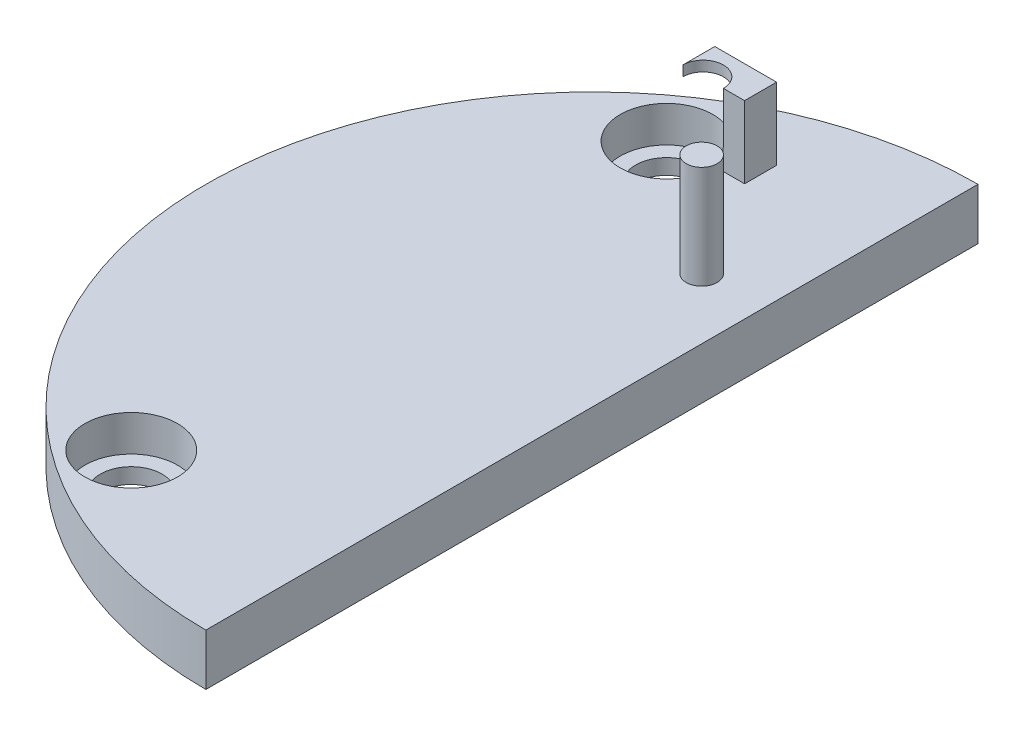
ISO-10303-21;
HEADER;
FILE_DESCRIPTION(('STEP AP214'),'2;1');
FILE_NAME('part.step','',(''),(''),'','','');
FILE_SCHEMA(('AUTOMOTIVE_DESIGN { 1 0 10303 214 1 1 1 1 }'));
ENDSEC;
DATA;
#1=APPLICATION_CONTEXT('core data for automotive mechanical design processes');
#2=APPLICATION_PROTOCOL_DEFINITION('international standard','automotive_design',2000,#1);
#3=PRODUCT_CONTEXT('',#1,'mechanical');
#4=PRODUCT('Part','Part','',(#3));
#5=PRODUCT_RELATED_PRODUCT_CATEGORY('part','',(#4));
#6=PRODUCT_DEFINITION_FORMATION('','',#4);
#7=PRODUCT_DEFINITION_CONTEXT('part definition',#1,'design');
#8=PRODUCT_DEFINITION('design','',#6,#7);
#9=PRODUCT_DEFINITION_SHAPE('','',#8);
#10=(LENGTH_UNIT() NAMED_UNIT(*) SI_UNIT(.MILLI.,.METRE.));
#11=(NAMED_UNIT(*) PLANE_ANGLE_UNIT() SI_UNIT($,.RADIAN.));
#12=(NAMED_UNIT(*) SI_UNIT($,.STERADIAN.) SOLID_ANGLE_UNIT());
#13=UNCERTAINTY_MEASURE_WITH_UNIT(LENGTH_MEASURE(1.E-05),#10,'distance_accuracy_value','');
#14=(GEOMETRIC_REPRESENTATION_CONTEXT(3) GLOBAL_UNCERTAINTY_ASSIGNED_CONTEXT((#13)) GLOBAL_UNIT_ASSIGNED_CONTEXT((#10,
#11,#12)) REPRESENTATION_CONTEXT('',''));
#15=CARTESIAN_POINT('',(0.,0.,0.));
#16=DIRECTION('',(0.,0.,1.));
#17=DIRECTION('',(1.,0.,0.));
#18=AXIS2_PLACEMENT_3D('',#15,#16,#17);
#19=CARTESIAN_POINT('',(0.,5.,37.5));
#20=DIRECTION('',(0.,-1.,0.));
#21=DIRECTION('',(0.,0.,-1.));
#22=AXIS2_PLACEMENT_3D('',#19,#20,#21);
#23=PLANE('',#22);
#24=CARTESIAN_POINT('',(-5.90512094525042,5.,20.9372129422284));
#25=DIRECTION('',(0.,-1.,0.));
#26=DIRECTION('',(0.,0.,-1.));
#27=AXIS2_PLACEMENT_3D('',#24,#25,#26);
#28=CIRCLE('',#27,1.5);
#29=CARTESIAN_POINT('',(-5.90512094525042,5.,19.4372129422284));
#30=VERTEX_POINT('',#29);
#31=EDGE_CURVE('E11',#30,#30,#28,.F.);
#32=ORIENTED_EDGE('',*,*,#31,.F.);
#33=EDGE_LOOP('',(#32));
#34=FACE_BOUND('',#33,.T.);
#35=CARTESIAN_POINT('',(0.,5.,37.5));
#36=DIRECTION('',(0.,1.,0.));
#37=DIRECTION('',(0.,0.,-1.));
#38=AXIS2_PLACEMENT_3D('',#35,#36,#37);
#39=CIRCLE('',#38,37.5);
#40=CARTESIAN_POINT('',(0.,5.,0.));
#41=VERTEX_POINT('',#40);
#42=CARTESIAN_POINT('',(0.,5.,75.));
#43=VERTEX_POINT('',#42);
#44=EDGE_CURVE('E208',#41,#43,#39,.T.);
#45=ORIENTED_EDGE('',*,*,#44,.T.);
#46=DIRECTION('',(0.,0.,-1.));
#47=VECTOR('',#46,1.);
#48=CARTESIAN_POINT('',(0.,5.,0.));
#49=LINE('',#48,#47);
#50=EDGE_CURVE('E211',#43,#41,#49,.T.);
#51=ORIENTED_EDGE('',*,*,#50,.T.);
#52=EDGE_LOOP('',(#45,#51));
#53=FACE_BOUND('',#52,.T.);
#54=CARTESIAN_POINT('',(-18.75,5.,63.5));
#55=DIRECTION('',(0.,1.,0.));
#56=DIRECTION('',(0.,0.,1.));
#57=AXIS2_PLACEMENT_3D('',#54,#55,#56);
#58=CIRCLE('',#57,4.5);
#59=CARTESIAN_POINT('',(-18.75,5.,68.));
#60=VERTEX_POINT('',#59);
#61=EDGE_CURVE('E187',#60,#60,#58,.T.);
#62=ORIENTED_EDGE('',*,*,#61,.F.);
#63=EDGE_LOOP('',(#62));
#64=FACE_BOUND('',#63,.T.);
#65=CARTESIAN_POINT('',(-18.75,5.,11.5));
#66=DIRECTION('',(0.,1.,0.));
#67=DIRECTION('',(0.,0.,1.));
#68=AXIS2_PLACEMENT_3D('',#65,#66,#67);
#69=CIRCLE('',#68,4.5);
#70=CARTESIAN_POINT('',(-18.75,5.,16.));
#71=VERTEX_POINT('',#70);
#72=EDGE_CURVE('E200',#71,#71,#69,.T.);
#73=ORIENTED_EDGE('',*,*,#72,.F.);
#74=EDGE_LOOP('',(#73));
#75=FACE_BOUND('',#74,.T.);
#76=DIRECTION('',(0.,0.,1.));
#77=VECTOR('',#76,1.);
#78=CARTESIAN_POINT('',(-13.4590865717171,5.,8.19163565060603));
#79=LINE('',#78,#77);
#80=CARTESIAN_POINT('',(-13.4590865717171,5.,8.19163565060603));
#81=VERTEX_POINT('',#80);
#82=CARTESIAN_POINT('',(-13.4590865717171,5.,11.2984068210427));
#83=VERTEX_POINT('',#82);
#84=EDGE_CURVE('E161',#81,#83,#79,.T.);
#85=ORIENTED_EDGE('',*,*,#84,.F.);
#86=DIRECTION('',(-1.,0.,0.));
#87=VECTOR('',#86,1.);
#88=CARTESIAN_POINT('',(-11.3733239640253,5.,8.19163565060603));
#89=LINE('',#88,#87);
#90=CARTESIAN_POINT('',(-11.3733239640253,5.,8.19163565060603));
#91=VERTEX_POINT('',#90);
#92=EDGE_CURVE('E166',#91,#81,#89,.T.);
#93=ORIENTED_EDGE('',*,*,#92,.F.);
#94=DIRECTION('',(0.,0.,-1.));
#95=VECTOR('',#94,1.);
#96=CARTESIAN_POINT('',(-11.3733239640253,5.,8.19163565060603));
#97=LINE('',#96,#95);
#98=CARTESIAN_POINT('',(-11.3733239640253,5.,11.2984068210427));
#99=VERTEX_POINT('',#98);
#100=EDGE_CURVE('E61',#99,#91,#97,.T.);
#101=ORIENTED_EDGE('',*,*,#100,.F.);
#102=DIRECTION('',(1.,0.,0.));
#103=VECTOR('',#102,1.);
#104=CARTESIAN_POINT('',(-13.4590865717171,5.,11.2984068210427));
#105=LINE('',#104,#103);
#106=EDGE_CURVE('E169',#83,#99,#105,.T.);
#107=ORIENTED_EDGE('',*,*,#106,.F.);
#108=EDGE_LOOP('',(#85,#93,#101,#107));
#109=FACE_BOUND('',#108,.T.);
#110=ADVANCED_FACE('F39',(#34,#53,#64,#75,#109),#23,.F.);
#111=CARTESIAN_POINT('',(0.,5.,37.5));
#112=DIRECTION('',(0.,-1.,0.));
#113=DIRECTION('',(0.,0.,-1.));
#114=AXIS2_PLACEMENT_3D('',#111,#112,#113);
#115=CYLINDRICAL_SURFACE('',#114,37.5);
#116=CARTESIAN_POINT('',(0.,0.,37.5));
#117=DIRECTION('',(0.,1.,0.));
#118=DIRECTION('',(0.,0.,-1.));
#119=AXIS2_PLACEMENT_3D('',#116,#117,#118);
#120=CIRCLE('',#119,37.5);
#121=CARTESIAN_POINT('',(0.,0.,0.));
#122=VERTEX_POINT('',#121);
#123=CARTESIAN_POINT('',(0.,0.,75.));
#124=VERTEX_POINT('',#123);
#125=EDGE_CURVE('E199',#122,#124,#120,.T.);
#126=ORIENTED_EDGE('',*,*,#125,.T.);
#127=DIRECTION('',(0.,-1.,0.));
#128=VECTOR('',#127,1.);
#129=CARTESIAN_POINT('',(0.,5.,75.));
#130=LINE('',#129,#128);
#131=EDGE_CURVE('E220',#43,#124,#130,.T.);
#132=ORIENTED_EDGE('',*,*,#131,.F.);
#133=ORIENTED_EDGE('',*,*,#44,.F.);
#134=DIRECTION('',(0.,-1.,0.));
#135=VECTOR('',#134,1.);
#136=CARTESIAN_POINT('',(0.,5.,0.));
#137=LINE('',#136,#135);
#138=EDGE_CURVE('E214',#41,#122,#137,.T.);
#139=ORIENTED_EDGE('',*,*,#138,.T.);
#140=EDGE_LOOP('',(#126,#132,#133,#139));
#141=FACE_BOUND('',#140,.T.);
#142=ADVANCED_FACE('F41',(#141),#115,.T.);
#143=CARTESIAN_POINT('',(0.,5.,0.));
#144=DIRECTION('',(-1.,0.,0.));
#145=DIRECTION('',(0.,0.,1.));
#146=AXIS2_PLACEMENT_3D('',#143,#144,#145);
#147=PLANE('',#146);
#148=DIRECTION('',(0.,0.,-1.));
#149=VECTOR('',#148,1.);
#150=CARTESIAN_POINT('',(0.,0.,0.));
#151=LINE('',#150,#149);
#152=EDGE_CURVE('E212',#124,#122,#151,.T.);
#153=ORIENTED_EDGE('',*,*,#152,.T.);
#154=ORIENTED_EDGE('',*,*,#138,.F.);
#155=ORIENTED_EDGE('',*,*,#50,.F.);
#156=ORIENTED_EDGE('',*,*,#131,.T.);
#157=EDGE_LOOP('',(#153,#154,#155,#156));
#158=FACE_BOUND('',#157,.T.);
#159=ADVANCED_FACE('F287',(#158),#147,.F.);
#160=CARTESIAN_POINT('',(0.,0.,37.5));
#161=DIRECTION('',(0.,-1.,0.));
#162=DIRECTION('',(0.,0.,-1.));
#163=AXIS2_PLACEMENT_3D('',#160,#161,#162);
#164=PLANE('',#163);
#165=CARTESIAN_POINT('',(-18.75,0.,63.5));
#166=DIRECTION('',(0.,1.,0.));
#167=DIRECTION('',(0.,0.,1.));
#168=AXIS2_PLACEMENT_3D('',#165,#166,#167);
#169=CIRCLE('',#168,3.);
#170=CARTESIAN_POINT('',(-18.75,0.,66.5));
#171=VERTEX_POINT('',#170);
#172=EDGE_CURVE('E184',#171,#171,#169,.T.);
#173=ORIENTED_EDGE('',*,*,#172,.T.);
#174=EDGE_LOOP('',(#173));
#175=FACE_BOUND('',#174,.T.);
#176=CARTESIAN_POINT('',(-18.75,0.,11.5));
#177=DIRECTION('',(0.,1.,0.));
#178=DIRECTION('',(0.,0.,1.));
#179=AXIS2_PLACEMENT_3D('',#176,#177,#178);
#180=CIRCLE('',#179,3.);
#181=CARTESIAN_POINT('',(-18.75,0.,14.5));
#182=VERTEX_POINT('',#181);
#183=EDGE_CURVE('E191',#182,#182,#180,.T.);
#184=ORIENTED_EDGE('',*,*,#183,.T.);
#185=EDGE_LOOP('',(#184));
#186=FACE_BOUND('',#185,.T.);
#187=ORIENTED_EDGE('',*,*,#125,.F.);
#188=ORIENTED_EDGE('',*,*,#152,.F.);
#189=EDGE_LOOP('',(#187,#188));
#190=FACE_BOUND('',#189,.T.);
#191=ADVANCED_FACE('F283',(#175,#186,#190),#164,.T.);
#192=CARTESIAN_POINT('',(-18.75,1.5,63.5));
#193=DIRECTION('',(0.,1.,0.));
#194=DIRECTION('',(0.,0.,1.));
#195=AXIS2_PLACEMENT_3D('',#192,#193,#194);
#196=CYLINDRICAL_SURFACE('',#195,4.5);
#197=CARTESIAN_POINT('',(-18.75,1.5,63.5));
#198=DIRECTION('',(0.,1.,0.));
#199=DIRECTION('',(0.,0.,1.));
#200=AXIS2_PLACEMENT_3D('',#197,#198,#199);
#201=CIRCLE('',#200,4.5);
#202=CARTESIAN_POINT('',(-18.75,1.5,68.));
#203=VERTEX_POINT('',#202);
#204=EDGE_CURVE('E203',#203,#203,#201,.T.);
#205=ORIENTED_EDGE('',*,*,#204,.F.);
#206=EDGE_LOOP('',(#205));
#207=FACE_BOUND('',#206,.T.);
#208=ORIENTED_EDGE('',*,*,#61,.T.);
#209=EDGE_LOOP('',(#208));
#210=FACE_BOUND('',#209,.T.);
#211=ADVANCED_FACE('F276',(#207,#210),#196,.F.);
#212=CARTESIAN_POINT('',(-18.75,1.5,63.5));
#213=DIRECTION('',(0.,1.,0.));
#214=DIRECTION('',(0.,0.,1.));
#215=AXIS2_PLACEMENT_3D('',#212,#213,#214);
#216=PLANE('',#215);
#217=CARTESIAN_POINT('',(-18.75,1.5,63.5));
#218=DIRECTION('',(0.,1.,0.));
#219=DIRECTION('',(0.,0.,1.));
#220=AXIS2_PLACEMENT_3D('',#217,#218,#219);
#221=CIRCLE('',#220,3.);
#222=CARTESIAN_POINT('',(-18.75,1.5,66.5));
#223=VERTEX_POINT('',#222);
#224=EDGE_CURVE('E188',#223,#223,#221,.T.);
#225=ORIENTED_EDGE('',*,*,#224,.F.);
#226=EDGE_LOOP('',(#225));
#227=FACE_BOUND('',#226,.T.);
#228=ORIENTED_EDGE('',*,*,#204,.T.);
#229=EDGE_LOOP('',(#228));
#230=FACE_BOUND('',#229,.T.);
#231=ADVANCED_FACE('F266',(#227,#230),#216,.T.);
#232=CARTESIAN_POINT('',(-18.75,1.5,11.5));
#233=DIRECTION('',(0.,1.,0.));
#234=DIRECTION('',(0.,0.,1.));
#235=AXIS2_PLACEMENT_3D('',#232,#233,#234);
#236=CYLINDRICAL_SURFACE('',#235,4.5);
#237=CARTESIAN_POINT('',(-18.75,1.5,11.5));
#238=DIRECTION('',(0.,1.,0.));
#239=DIRECTION('',(0.,0.,1.));
#240=AXIS2_PLACEMENT_3D('',#237,#238,#239);
#241=CIRCLE('',#240,4.5);
#242=CARTESIAN_POINT('',(-18.75,1.5,16.));
#243=VERTEX_POINT('',#242);
#244=EDGE_CURVE('E196',#243,#243,#241,.T.);
#245=ORIENTED_EDGE('',*,*,#244,.F.);
#246=EDGE_LOOP('',(#245));
#247=FACE_BOUND('',#246,.T.);
#248=ORIENTED_EDGE('',*,*,#72,.T.);
#249=EDGE_LOOP('',(#248));
#250=FACE_BOUND('',#249,.T.);
#251=ADVANCED_FACE('F263',(#247,#250),#236,.F.);
#252=CARTESIAN_POINT('',(-18.75,1.5,11.5));
#253=DIRECTION('',(0.,1.,0.));
#254=DIRECTION('',(0.,0.,1.));
#255=AXIS2_PLACEMENT_3D('',#252,#253,#254);
#256=PLANE('',#255);
#257=CARTESIAN_POINT('',(-18.75,1.5,11.5));
#258=DIRECTION('',(0.,1.,0.));
#259=DIRECTION('',(0.,0.,1.));
#260=AXIS2_PLACEMENT_3D('',#257,#258,#259);
#261=CIRCLE('',#260,3.);
#262=CARTESIAN_POINT('',(-18.75,1.5,14.5));
#263=VERTEX_POINT('',#262);
#264=EDGE_CURVE('E183',#263,#263,#261,.T.);
#265=ORIENTED_EDGE('',*,*,#264,.F.);
#266=EDGE_LOOP('',(#265));
#267=FACE_BOUND('',#266,.T.);
#268=ORIENTED_EDGE('',*,*,#244,.T.);
#269=EDGE_LOOP('',(#268));
#270=FACE_BOUND('',#269,.T.);
#271=ADVANCED_FACE('F265',(#267,#270),#256,.T.);
#272=CARTESIAN_POINT('',(-18.75,0.,11.5));
#273=DIRECTION('',(0.,1.,0.));
#274=DIRECTION('',(0.,0.,1.));
#275=AXIS2_PLACEMENT_3D('',#272,#273,#274);
#276=CYLINDRICAL_SURFACE('',#275,3.);
#277=ORIENTED_EDGE('',*,*,#183,.F.);
#278=EDGE_LOOP('',(#277));
#279=FACE_BOUND('',#278,.T.);
#280=ORIENTED_EDGE('',*,*,#264,.T.);
#281=EDGE_LOOP('',(#280));
#282=FACE_BOUND('',#281,.T.);
#283=ADVANCED_FACE('F273',(#279,#282),#276,.F.);
#284=CARTESIAN_POINT('',(-18.75,0.,63.5));
#285=DIRECTION('',(0.,1.,0.));
#286=DIRECTION('',(0.,0.,1.));
#287=AXIS2_PLACEMENT_3D('',#284,#285,#286);
#288=CYLINDRICAL_SURFACE('',#287,3.);
#289=ORIENTED_EDGE('',*,*,#172,.F.);
#290=EDGE_LOOP('',(#289));
#291=FACE_BOUND('',#290,.T.);
#292=ORIENTED_EDGE('',*,*,#224,.T.);
#293=EDGE_LOOP('',(#292));
#294=FACE_BOUND('',#293,.T.);
#295=ADVANCED_FACE('F349',(#291,#294),#288,.F.);
#296=CARTESIAN_POINT('',(-13.4590865717171,11.,8.19163565060603));
#297=DIRECTION('',(1.,0.,0.));
#298=DIRECTION('',(0.,0.,-1.));
#299=AXIS2_PLACEMENT_3D('',#296,#297,#298);
#300=PLANE('',#299);
#301=DIRECTION('',(0.,0.,1.));
#302=VECTOR('',#301,1.);
#303=CARTESIAN_POINT('',(-13.4590865717171,7.,8.19163565060603));
#304=LINE('',#303,#302);
#305=CARTESIAN_POINT('',(-13.4590865717171,7.,10.9612709777923));
#306=VERTEX_POINT('',#305);
#307=CARTESIAN_POINT('',(-13.4590865717171,7.,11.2984068210427));
#308=VERTEX_POINT('',#307);
#309=EDGE_CURVE('E121',#306,#308,#304,.T.);
#310=ORIENTED_EDGE('',*,*,#309,.F.);
#311=DIRECTION('',(0.,1.,0.));
#312=VECTOR('',#311,1.);
#313=CARTESIAN_POINT('',(-13.4590865717171,7.,10.9612709777923));
#314=LINE('',#313,#312);
#315=CARTESIAN_POINT('',(-13.4590865717171,11.,10.9612709777923));
#316=VERTEX_POINT('',#315);
#317=EDGE_CURVE('E129',#306,#316,#314,.T.);
#318=ORIENTED_EDGE('',*,*,#317,.T.);
#319=DIRECTION('',(0.,0.,1.));
#320=VECTOR('',#319,1.);
#321=CARTESIAN_POINT('',(-13.4590865717171,11.,8.19163565060603));
#322=LINE('',#321,#320);
#323=CARTESIAN_POINT('',(-13.4590865717171,11.,8.19163565060603));
#324=VERTEX_POINT('',#323);
#325=EDGE_CURVE('E162',#324,#316,#322,.T.);
#326=ORIENTED_EDGE('',*,*,#325,.F.);
#327=DIRECTION('',(0.,-1.,0.));
#328=VECTOR('',#327,1.);
#329=CARTESIAN_POINT('',(-13.4590865717171,11.,8.19163565060603));
#330=LINE('',#329,#328);
#331=EDGE_CURVE('E165',#324,#81,#330,.T.);
#332=ORIENTED_EDGE('',*,*,#331,.T.);
#333=ORIENTED_EDGE('',*,*,#84,.T.);
#334=DIRECTION('',(0.,-1.,0.));
#335=VECTOR('',#334,1.);
#336=CARTESIAN_POINT('',(-13.4590865717171,11.,11.2984068210427));
#337=LINE('',#336,#335);
#338=EDGE_CURVE('E54',#308,#83,#337,.T.);
#339=ORIENTED_EDGE('',*,*,#338,.F.);
#340=EDGE_LOOP('',(#310,#318,#326,#332,#333,#339));
#341=FACE_BOUND('',#340,.T.);
#342=ADVANCED_FACE('F228',(#341),#300,.F.);
#343=CARTESIAN_POINT('',(-13.4590865717171,11.,11.2984068210427));
#344=DIRECTION('',(0.,0.,-1.));
#345=DIRECTION('',(-1.,0.,0.));
#346=AXIS2_PLACEMENT_3D('',#343,#344,#345);
#347=PLANE('',#346);
#348=DIRECTION('',(1.,0.,0.));
#349=VECTOR('',#348,1.);
#350=CARTESIAN_POINT('',(-11.3733239640253,12.,11.2984068210427));
#351=LINE('',#350,#349);
#352=CARTESIAN_POINT('',(-13.4300488396093,12.,11.2984068210427));
#353=VERTEX_POINT('',#352);
#354=CARTESIAN_POINT('',(-11.3733239640253,12.,11.2984068210427));
#355=VERTEX_POINT('',#354);
#356=EDGE_CURVE('E135',#353,#355,#351,.T.);
#357=ORIENTED_EDGE('',*,*,#356,.F.);
#358=DIRECTION('',(0.,1.,0.));
#359=VECTOR('',#358,1.);
#360=CARTESIAN_POINT('',(-13.4300488396093,7.,11.2984068210427));
#361=LINE('',#360,#359);
#362=CARTESIAN_POINT('',(-13.4300488396093,7.,11.2984068210427));
#363=VERTEX_POINT('',#362);
#364=EDGE_CURVE('E123',#363,#353,#361,.T.);
#365=ORIENTED_EDGE('',*,*,#364,.F.);
#366=DIRECTION('',(1.,0.,0.));
#367=VECTOR('',#366,1.);
#368=CARTESIAN_POINT('',(-17.3733239640253,7.,11.2984068210427));
#369=LINE('',#368,#367);
#370=EDGE_CURVE('E116',#308,#363,#369,.T.);
#371=ORIENTED_EDGE('',*,*,#370,.F.);
#372=ORIENTED_EDGE('',*,*,#338,.T.);
#373=ORIENTED_EDGE('',*,*,#106,.T.);
#374=DIRECTION('',(0.,-1.,0.));
#375=VECTOR('',#374,1.);
#376=CARTESIAN_POINT('',(-11.3733239640253,11.,11.2984068210427));
#377=LINE('',#376,#375);
#378=EDGE_CURVE('E179',#355,#99,#377,.T.);
#379=ORIENTED_EDGE('',*,*,#378,.F.);
#380=EDGE_LOOP('',(#357,#365,#371,#372,#373,#379));
#381=FACE_BOUND('',#380,.T.);
#382=ADVANCED_FACE('F133',(#381),#347,.F.);
#383=CARTESIAN_POINT('',(-11.3733239640253,11.,8.19163565060603));
#384=DIRECTION('',(-1.,0.,0.));
#385=DIRECTION('',(0.,0.,1.));
#386=AXIS2_PLACEMENT_3D('',#383,#384,#385);
#387=PLANE('',#386);
#388=ORIENTED_EDGE('',*,*,#100,.T.);
#389=DIRECTION('',(0.,-1.,0.));
#390=VECTOR('',#389,1.);
#391=CARTESIAN_POINT('',(-11.3733239640253,11.,8.19163565060603));
#392=LINE('',#391,#390);
#393=CARTESIAN_POINT('',(-11.3733239640253,12.,8.19163565060603));
#394=VERTEX_POINT('',#393);
#395=EDGE_CURVE('E176',#394,#91,#392,.T.);
#396=ORIENTED_EDGE('',*,*,#395,.F.);
#397=DIRECTION('',(0.,0.,-1.));
#398=VECTOR('',#397,1.);
#399=CARTESIAN_POINT('',(-11.3733239640253,12.,8.19163565060603));
#400=LINE('',#399,#398);
#401=EDGE_CURVE('E150',#355,#394,#400,.T.);
#402=ORIENTED_EDGE('',*,*,#401,.F.);
#403=ORIENTED_EDGE('',*,*,#378,.T.);
#404=EDGE_LOOP('',(#388,#396,#402,#403));
#405=FACE_BOUND('',#404,.T.);
#406=ADVANCED_FACE('F237',(#405),#387,.F.);
#407=CARTESIAN_POINT('',(-11.3733239640253,11.,8.19163565060603));
#408=DIRECTION('',(0.,0.,1.));
#409=DIRECTION('',(1.,0.,0.));
#410=AXIS2_PLACEMENT_3D('',#407,#408,#409);
#411=PLANE('',#410);
#412=ORIENTED_EDGE('',*,*,#92,.T.);
#413=ORIENTED_EDGE('',*,*,#331,.F.);
#414=DIRECTION('',(-1.,0.,0.));
#415=VECTOR('',#414,1.);
#416=CARTESIAN_POINT('',(-17.3733239640253,11.,8.19163565060603));
#417=LINE('',#416,#415);
#418=CARTESIAN_POINT('',(-17.3733239640253,11.,8.19163565060603));
#419=VERTEX_POINT('',#418);
#420=EDGE_CURVE('E141',#324,#419,#417,.T.);
#421=ORIENTED_EDGE('',*,*,#420,.T.);
#422=DIRECTION('',(0.,-1.,0.));
#423=VECTOR('',#422,1.);
#424=CARTESIAN_POINT('',(-17.3733239640253,12.,8.19163565060603));
#425=LINE('',#424,#423);
#426=CARTESIAN_POINT('',(-17.3733239640253,12.,8.19163565060603));
#427=VERTEX_POINT('',#426);
#428=EDGE_CURVE('E158',#427,#419,#425,.T.);
#429=ORIENTED_EDGE('',*,*,#428,.F.);
#430=DIRECTION('',(-1.,0.,0.));
#431=VECTOR('',#430,1.);
#432=CARTESIAN_POINT('',(-17.3733239640253,12.,8.19163565060603));
#433=LINE('',#432,#431);
#434=EDGE_CURVE('E142',#394,#427,#433,.T.);
#435=ORIENTED_EDGE('',*,*,#434,.F.);
#436=ORIENTED_EDGE('',*,*,#395,.T.);
#437=EDGE_LOOP('',(#412,#413,#421,#429,#435,#436));
#438=FACE_BOUND('',#437,.T.);
#439=ADVANCED_FACE('F233',(#438),#411,.F.);
#440=CARTESIAN_POINT('',(-17.3733239640253,12.,11.2984068210427));
#441=DIRECTION('',(1.,0.,0.));
#442=DIRECTION('',(0.,0.,-1.));
#443=AXIS2_PLACEMENT_3D('',#440,#441,#442);
#444=PLANE('',#443);
#445=DIRECTION('',(0.,0.,1.));
#446=VECTOR('',#445,1.);
#447=CARTESIAN_POINT('',(-17.3733239640253,11.,11.2984068210427));
#448=LINE('',#447,#446);
#449=CARTESIAN_POINT('',(-17.3733239640253,11.,11.2984068210427));
#450=VERTEX_POINT('',#449);
#451=EDGE_CURVE('E146',#419,#450,#448,.T.);
#452=ORIENTED_EDGE('',*,*,#451,.T.);
#453=DIRECTION('',(0.,-1.,0.));
#454=VECTOR('',#453,1.);
#455=CARTESIAN_POINT('',(-17.3733239640253,12.,11.2984068210427));
#456=LINE('',#455,#454);
#457=CARTESIAN_POINT('',(-17.3733239640253,12.,11.2984068210427));
#458=VERTEX_POINT('',#457);
#459=EDGE_CURVE('E153',#458,#450,#456,.T.);
#460=ORIENTED_EDGE('',*,*,#459,.F.);
#461=DIRECTION('',(0.,0.,1.));
#462=VECTOR('',#461,1.);
#463=CARTESIAN_POINT('',(-17.3733239640253,12.,11.2984068210427));
#464=LINE('',#463,#462);
#465=EDGE_CURVE('E145',#427,#458,#464,.T.);
#466=ORIENTED_EDGE('',*,*,#465,.F.);
#467=ORIENTED_EDGE('',*,*,#428,.T.);
#468=EDGE_LOOP('',(#452,#460,#466,#467));
#469=FACE_BOUND('',#468,.T.);
#470=ADVANCED_FACE('F335',(#469),#444,.F.);
#471=CARTESIAN_POINT('',(0.,12.,0.));
#472=DIRECTION('',(0.,-1.,0.));
#473=DIRECTION('',(0.,0.,-1.));
#474=AXIS2_PLACEMENT_3D('',#471,#472,#473);
#475=PLANE('',#474);
#476=ORIENTED_EDGE('',*,*,#465,.T.);
#477=CARTESIAN_POINT('',(-15.4016864018173,12.,11.2984068210427));
#478=DIRECTION('',(0.,1.,0.));
#479=DIRECTION('',(0.,0.,1.));
#480=AXIS2_PLACEMENT_3D('',#477,#478,#479);
#481=CIRCLE('',#480,1.97163756220801);
#482=EDGE_CURVE('E130',#353,#458,#481,.T.);
#483=ORIENTED_EDGE('',*,*,#482,.F.);
#484=ORIENTED_EDGE('',*,*,#356,.T.);
#485=ORIENTED_EDGE('',*,*,#401,.T.);
#486=ORIENTED_EDGE('',*,*,#434,.T.);
#487=EDGE_LOOP('',(#476,#483,#484,#485,#486));
#488=FACE_BOUND('',#487,.T.);
#489=ADVANCED_FACE('F239',(#488),#475,.F.);
#490=CARTESIAN_POINT('',(0.,11.,0.));
#491=DIRECTION('',(0.,-1.,0.));
#492=DIRECTION('',(0.,0.,-1.));
#493=AXIS2_PLACEMENT_3D('',#490,#491,#492);
#494=PLANE('',#493);
#495=CARTESIAN_POINT('',(-15.4016864018173,11.,11.2984068210427));
#496=DIRECTION('',(0.,-1.,0.));
#497=DIRECTION('',(0.,0.,-1.));
#498=AXIS2_PLACEMENT_3D('',#495,#496,#497);
#499=CIRCLE('',#498,1.97163756220801);
#500=EDGE_CURVE('E47',#450,#316,#499,.T.);
#501=ORIENTED_EDGE('',*,*,#500,.F.);
#502=ORIENTED_EDGE('',*,*,#451,.F.);
#503=ORIENTED_EDGE('',*,*,#420,.F.);
#504=ORIENTED_EDGE('',*,*,#325,.T.);
#505=EDGE_LOOP('',(#501,#502,#503,#504));
#506=FACE_BOUND('',#505,.T.);
#507=ADVANCED_FACE('F230',(#506),#494,.T.);
#508=CARTESIAN_POINT('',(-15.4016864018173,7.,11.2984068210427));
#509=DIRECTION('',(0.,1.,0.));
#510=DIRECTION('',(0.,0.,1.));
#511=AXIS2_PLACEMENT_3D('',#508,#509,#510);
#512=PLANE('',#511);
#513=ORIENTED_EDGE('',*,*,#309,.T.);
#514=ORIENTED_EDGE('',*,*,#370,.T.);
#515=CARTESIAN_POINT('',(-15.4016864018173,7.,11.2984068210427));
#516=DIRECTION('',(0.,1.,0.));
#517=DIRECTION('',(0.,0.,1.));
#518=AXIS2_PLACEMENT_3D('',#515,#516,#517);
#519=CIRCLE('',#518,1.97163756220801);
#520=EDGE_CURVE('E119',#363,#306,#519,.T.);
#521=ORIENTED_EDGE('',*,*,#520,.T.);
#522=EDGE_LOOP('',(#513,#514,#521));
#523=FACE_BOUND('',#522,.T.);
#524=ADVANCED_FACE('F118',(#523),#512,.T.);
#525=CARTESIAN_POINT('',(-15.4016864018173,7.,11.2984068210427));
#526=DIRECTION('',(0.,1.,0.));
#527=DIRECTION('',(0.,0.,1.));
#528=AXIS2_PLACEMENT_3D('',#525,#526,#527);
#529=CYLINDRICAL_SURFACE('',#528,1.97163756220801);
#530=ORIENTED_EDGE('',*,*,#520,.F.);
#531=ORIENTED_EDGE('',*,*,#364,.T.);
#532=ORIENTED_EDGE('',*,*,#482,.T.);
#533=ORIENTED_EDGE('',*,*,#459,.T.);
#534=ORIENTED_EDGE('',*,*,#500,.T.);
#535=ORIENTED_EDGE('',*,*,#317,.F.);
#536=EDGE_LOOP('',(#530,#531,#532,#533,#534,#535));
#537=FACE_BOUND('',#536,.T.);
#538=ADVANCED_FACE('F126',(#537),#529,.F.);
#539=CARTESIAN_POINT('',(-5.90512094525042,15.,20.9372129422284));
#540=DIRECTION('',(0.,-1.,0.));
#541=DIRECTION('',(0.,0.,-1.));
#542=AXIS2_PLACEMENT_3D('',#539,#540,#541);
#543=CYLINDRICAL_SURFACE('',#542,1.5);
#544=CARTESIAN_POINT('',(-5.90512094525042,15.,20.9372129422284));
#545=DIRECTION('',(0.,1.,0.));
#546=DIRECTION('',(0.,0.,1.));
#547=AXIS2_PLACEMENT_3D('',#544,#545,#546);
#548=CIRCLE('',#547,1.5);
#549=CARTESIAN_POINT('',(-5.90512094525042,15.,22.4372129422284));
#550=VERTEX_POINT('',#549);
#551=EDGE_CURVE('E240',#550,#550,#548,.T.);
#552=ORIENTED_EDGE('',*,*,#551,.F.);
#553=EDGE_LOOP('',(#552));
#554=FACE_BOUND('',#553,.T.);
#555=ORIENTED_EDGE('',*,*,#31,.T.);
#556=EDGE_LOOP('',(#555));
#557=FACE_BOUND('',#556,.T.);
#558=ADVANCED_FACE('F247',(#554,#557),#543,.T.);
#559=CARTESIAN_POINT('',(-5.90512094525042,15.,20.9372129422284));
#560=DIRECTION('',(0.,1.,0.));
#561=DIRECTION('',(0.,0.,1.));
#562=AXIS2_PLACEMENT_3D('',#559,#560,#561);
#563=PLANE('',#562);
#564=ORIENTED_EDGE('',*,*,#551,.T.);
#565=EDGE_LOOP('',(#564));
#566=FACE_BOUND('',#565,.T.);
#567=ADVANCED_FACE('F245',(#566),#563,.T.);
#568=CLOSED_SHELL('',(#110,#142,#159,#191,#211,#231,#251,#271,#283,#295,#342,#382,#406,#439,
#470,#489,#507,#524,#538,#558,#567));
#569=MANIFOLD_SOLID_BREP('B2',#568);
#570=ADVANCED_BREP_SHAPE_REPRESENTATION('',(#18,#569),#14);
#571=SHAPE_DEFINITION_REPRESENTATION(#9,#570);
ENDSEC;
END-ISO-10303-21;
